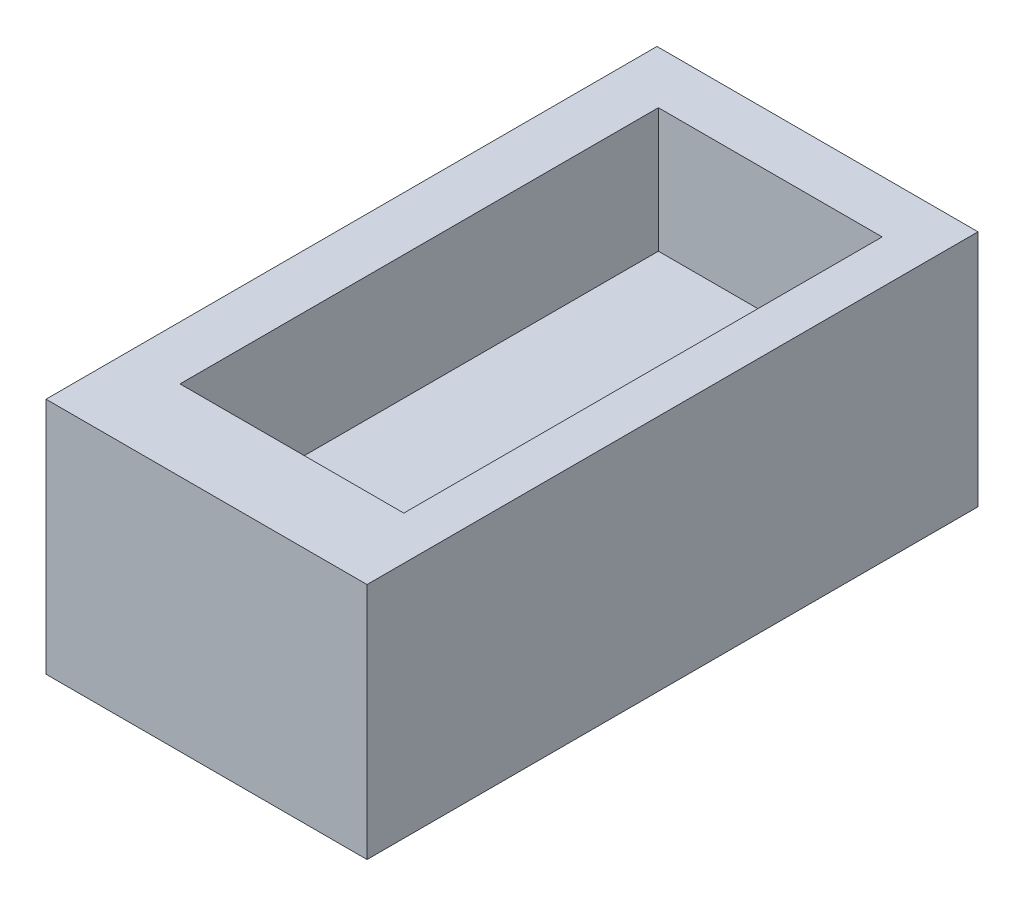
ISO-10303-21;
HEADER;
FILE_DESCRIPTION(('STEP AP214'),'2;1');
FILE_NAME('part.step','',(''),(''),'','','');
FILE_SCHEMA(('AUTOMOTIVE_DESIGN { 1 0 10303 214 1 1 1 1 }'));
ENDSEC;
DATA;
#1=APPLICATION_CONTEXT('core data for automotive mechanical design processes');
#2=APPLICATION_PROTOCOL_DEFINITION('international standard','automotive_design',2000,#1);
#3=PRODUCT_CONTEXT('',#1,'mechanical');
#4=PRODUCT('Part','Part','',(#3));
#5=PRODUCT_RELATED_PRODUCT_CATEGORY('part','',(#4));
#6=PRODUCT_DEFINITION_FORMATION('','',#4);
#7=PRODUCT_DEFINITION_CONTEXT('part definition',#1,'design');
#8=PRODUCT_DEFINITION('design','',#6,#7);
#9=PRODUCT_DEFINITION_SHAPE('','',#8);
#10=(LENGTH_UNIT() NAMED_UNIT(*) SI_UNIT(.MILLI.,.METRE.));
#11=(NAMED_UNIT(*) PLANE_ANGLE_UNIT() SI_UNIT($,.RADIAN.));
#12=(NAMED_UNIT(*) SI_UNIT($,.STERADIAN.) SOLID_ANGLE_UNIT());
#13=UNCERTAINTY_MEASURE_WITH_UNIT(LENGTH_MEASURE(1.E-05),#10,'distance_accuracy_value','');
#14=(GEOMETRIC_REPRESENTATION_CONTEXT(3) GLOBAL_UNCERTAINTY_ASSIGNED_CONTEXT((#13)) GLOBAL_UNIT_ASSIGNED_CONTEXT((#10,
#11,#12)) REPRESENTATION_CONTEXT('',''));
#15=CARTESIAN_POINT('',(0.,0.,0.));
#16=DIRECTION('',(0.,0.,1.));
#17=DIRECTION('',(1.,0.,0.));
#18=AXIS2_PLACEMENT_3D('',#15,#16,#17);
#19=CARTESIAN_POINT('',(-15.5,23.,29.5));
#20=DIRECTION('',(1.,0.,0.));
#21=DIRECTION('',(0.,0.,-1.));
#22=AXIS2_PLACEMENT_3D('',#19,#20,#21);
#23=PLANE('',#22);
#24=DIRECTION('',(0.,0.,1.));
#25=VECTOR('',#24,1.);
#26=CARTESIAN_POINT('',(-15.5,0.,29.5));
#27=LINE('',#26,#25);
#28=CARTESIAN_POINT('',(-15.5,0.,-29.5));
#29=VERTEX_POINT('',#28);
#30=CARTESIAN_POINT('',(-15.5,0.,29.5));
#31=VERTEX_POINT('',#30);
#32=EDGE_CURVE('E144',#29,#31,#27,.T.);
#33=ORIENTED_EDGE('',*,*,#32,.T.);
#34=DIRECTION('',(0.,-1.,0.));
#35=VECTOR('',#34,1.);
#36=CARTESIAN_POINT('',(-15.5,23.,29.5));
#37=LINE('',#36,#35);
#38=CARTESIAN_POINT('',(-15.5,23.,29.5));
#39=VERTEX_POINT('',#38);
#40=EDGE_CURVE('E11',#39,#31,#37,.T.);
#41=ORIENTED_EDGE('',*,*,#40,.F.);
#42=DIRECTION('',(0.,0.,1.));
#43=VECTOR('',#42,1.);
#44=CARTESIAN_POINT('',(-15.5,23.,29.5));
#45=LINE('',#44,#43);
#46=CARTESIAN_POINT('',(-15.5,23.,-29.5));
#47=VERTEX_POINT('',#46);
#48=EDGE_CURVE('E148',#47,#39,#45,.T.);
#49=ORIENTED_EDGE('',*,*,#48,.F.);
#50=DIRECTION('',(0.,-1.,0.));
#51=VECTOR('',#50,1.);
#52=CARTESIAN_POINT('',(-15.5,23.,-29.5));
#53=LINE('',#52,#51);
#54=EDGE_CURVE('E154',#47,#29,#53,.T.);
#55=ORIENTED_EDGE('',*,*,#54,.T.);
#56=EDGE_LOOP('',(#33,#41,#49,#55));
#57=FACE_BOUND('',#56,.T.);
#58=ADVANCED_FACE('F36',(#57),#23,.F.);
#59=CARTESIAN_POINT('',(15.5,23.,29.5));
#60=DIRECTION('',(0.,0.,-1.));
#61=DIRECTION('',(-1.,0.,0.));
#62=AXIS2_PLACEMENT_3D('',#59,#60,#61);
#63=PLANE('',#62);
#64=DIRECTION('',(1.,0.,0.));
#65=VECTOR('',#64,1.);
#66=CARTESIAN_POINT('',(15.5,0.,29.5));
#67=LINE('',#66,#65);
#68=CARTESIAN_POINT('',(15.5,0.,29.5));
#69=VERTEX_POINT('',#68);
#70=EDGE_CURVE('E157',#31,#69,#67,.T.);
#71=ORIENTED_EDGE('',*,*,#70,.T.);
#72=DIRECTION('',(0.,-1.,0.));
#73=VECTOR('',#72,1.);
#74=CARTESIAN_POINT('',(15.5,23.,29.5));
#75=LINE('',#74,#73);
#76=CARTESIAN_POINT('',(15.5,23.,29.5));
#77=VERTEX_POINT('',#76);
#78=EDGE_CURVE('E43',#77,#69,#75,.T.);
#79=ORIENTED_EDGE('',*,*,#78,.F.);
#80=DIRECTION('',(1.,0.,0.));
#81=VECTOR('',#80,1.);
#82=CARTESIAN_POINT('',(15.5,23.,29.5));
#83=LINE('',#82,#81);
#84=EDGE_CURVE('E87',#39,#77,#83,.T.);
#85=ORIENTED_EDGE('',*,*,#84,.F.);
#86=ORIENTED_EDGE('',*,*,#40,.T.);
#87=EDGE_LOOP('',(#71,#79,#85,#86));
#88=FACE_BOUND('',#87,.T.);
#89=ADVANCED_FACE('F186',(#88),#63,.F.);
#90=CARTESIAN_POINT('',(15.5,23.,29.5));
#91=DIRECTION('',(-1.,0.,0.));
#92=DIRECTION('',(0.,0.,1.));
#93=AXIS2_PLACEMENT_3D('',#90,#91,#92);
#94=PLANE('',#93);
#95=DIRECTION('',(0.,0.,-1.));
#96=VECTOR('',#95,1.);
#97=CARTESIAN_POINT('',(15.5,0.,29.5));
#98=LINE('',#97,#96);
#99=CARTESIAN_POINT('',(15.5,0.,-29.5));
#100=VERTEX_POINT('',#99);
#101=EDGE_CURVE('E159',#69,#100,#98,.T.);
#102=ORIENTED_EDGE('',*,*,#101,.T.);
#103=DIRECTION('',(0.,-1.,0.));
#104=VECTOR('',#103,1.);
#105=CARTESIAN_POINT('',(15.5,23.,-29.5));
#106=LINE('',#105,#104);
#107=CARTESIAN_POINT('',(15.5,23.,-29.5));
#108=VERTEX_POINT('',#107);
#109=EDGE_CURVE('E163',#108,#100,#106,.T.);
#110=ORIENTED_EDGE('',*,*,#109,.F.);
#111=DIRECTION('',(0.,0.,-1.));
#112=VECTOR('',#111,1.);
#113=CARTESIAN_POINT('',(15.5,23.,29.5));
#114=LINE('',#113,#112);
#115=EDGE_CURVE('E151',#77,#108,#114,.T.);
#116=ORIENTED_EDGE('',*,*,#115,.F.);
#117=ORIENTED_EDGE('',*,*,#78,.T.);
#118=EDGE_LOOP('',(#102,#110,#116,#117));
#119=FACE_BOUND('',#118,.T.);
#120=ADVANCED_FACE('F168',(#119),#94,.F.);
#121=CARTESIAN_POINT('',(15.5,23.,-29.5));
#122=DIRECTION('',(0.,0.,1.));
#123=DIRECTION('',(1.,0.,0.));
#124=AXIS2_PLACEMENT_3D('',#121,#122,#123);
#125=PLANE('',#124);
#126=DIRECTION('',(-1.,0.,0.));
#127=VECTOR('',#126,1.);
#128=CARTESIAN_POINT('',(15.5,0.,-29.5));
#129=LINE('',#128,#127);
#130=EDGE_CURVE('E80',#100,#29,#129,.T.);
#131=ORIENTED_EDGE('',*,*,#130,.T.);
#132=ORIENTED_EDGE('',*,*,#54,.F.);
#133=DIRECTION('',(-1.,0.,0.));
#134=VECTOR('',#133,1.);
#135=CARTESIAN_POINT('',(15.5,23.,-29.5));
#136=LINE('',#135,#134);
#137=EDGE_CURVE('E59',#108,#47,#136,.T.);
#138=ORIENTED_EDGE('',*,*,#137,.F.);
#139=ORIENTED_EDGE('',*,*,#109,.T.);
#140=EDGE_LOOP('',(#131,#132,#138,#139));
#141=FACE_BOUND('',#140,.T.);
#142=ADVANCED_FACE('F176',(#141),#125,.F.);
#143=CARTESIAN_POINT('',(0.,23.,0.));
#144=DIRECTION('',(0.,1.,0.));
#145=DIRECTION('',(0.,0.,1.));
#146=AXIS2_PLACEMENT_3D('',#143,#144,#145);
#147=PLANE('',#146);
#148=DIRECTION('',(0.,0.,1.));
#149=VECTOR('',#148,1.);
#150=CARTESIAN_POINT('',(-10.3074651415298,23.,-24.4444253245888));
#151=LINE('',#150,#149);
#152=CARTESIAN_POINT('',(-10.3074651415298,23.,-24.4444253245888));
#153=VERTEX_POINT('',#152);
#154=CARTESIAN_POINT('',(-10.3074651415298,23.,21.749943455478));
#155=VERTEX_POINT('',#154);
#156=EDGE_CURVE('E50',#153,#155,#151,.T.);
#157=ORIENTED_EDGE('',*,*,#156,.F.);
#158=DIRECTION('',(-1.,0.,0.));
#159=VECTOR('',#158,1.);
#160=CARTESIAN_POINT('',(-10.3074651415298,23.,-24.4444253245888));
#161=LINE('',#160,#159);
#162=CARTESIAN_POINT('',(11.3017315139032,23.,-24.4444253245888));
#163=VERTEX_POINT('',#162);
#164=EDGE_CURVE('E129',#163,#153,#161,.T.);
#165=ORIENTED_EDGE('',*,*,#164,.F.);
#166=DIRECTION('',(0.,0.,-1.));
#167=VECTOR('',#166,1.);
#168=CARTESIAN_POINT('',(11.3017315139032,23.,-24.4444253245888));
#169=LINE('',#168,#167);
#170=CARTESIAN_POINT('',(11.3017315139032,23.,21.749943455478));
#171=VERTEX_POINT('',#170);
#172=EDGE_CURVE('E132',#171,#163,#169,.T.);
#173=ORIENTED_EDGE('',*,*,#172,.F.);
#174=DIRECTION('',(1.,0.,0.));
#175=VECTOR('',#174,1.);
#176=CARTESIAN_POINT('',(-10.3074651415298,23.,21.749943455478));
#177=LINE('',#176,#175);
#178=EDGE_CURVE('E138',#155,#171,#177,.T.);
#179=ORIENTED_EDGE('',*,*,#178,.F.);
#180=EDGE_LOOP('',(#157,#165,#173,#179));
#181=FACE_BOUND('',#180,.T.);
#182=ORIENTED_EDGE('',*,*,#48,.T.);
#183=ORIENTED_EDGE('',*,*,#84,.T.);
#184=ORIENTED_EDGE('',*,*,#115,.T.);
#185=ORIENTED_EDGE('',*,*,#137,.T.);
#186=EDGE_LOOP('',(#182,#183,#184,#185));
#187=FACE_BOUND('',#186,.T.);
#188=ADVANCED_FACE('F178',(#181,#187),#147,.T.);
#189=CARTESIAN_POINT('',(0.,0.,0.));
#190=DIRECTION('',(0.,1.,0.));
#191=DIRECTION('',(0.,0.,1.));
#192=AXIS2_PLACEMENT_3D('',#189,#190,#191);
#193=PLANE('',#192);
#194=ORIENTED_EDGE('',*,*,#32,.F.);
#195=ORIENTED_EDGE('',*,*,#130,.F.);
#196=ORIENTED_EDGE('',*,*,#101,.F.);
#197=ORIENTED_EDGE('',*,*,#70,.F.);
#198=EDGE_LOOP('',(#194,#195,#196,#197));
#199=FACE_BOUND('',#198,.T.);
#200=ADVANCED_FACE('F172',(#199),#193,.F.);
#201=CARTESIAN_POINT('',(-10.3074651415298,11.,-24.4444253245888));
#202=DIRECTION('',(-1.,0.,0.));
#203=DIRECTION('',(0.,0.,1.));
#204=AXIS2_PLACEMENT_3D('',#201,#202,#203);
#205=PLANE('',#204);
#206=ORIENTED_EDGE('',*,*,#156,.T.);
#207=DIRECTION('',(0.,1.,0.));
#208=VECTOR('',#207,1.);
#209=CARTESIAN_POINT('',(-10.3074651415298,11.,21.749943455478));
#210=LINE('',#209,#208);
#211=CARTESIAN_POINT('',(-10.3074651415298,11.,21.749943455478));
#212=VERTEX_POINT('',#211);
#213=EDGE_CURVE('E107',#212,#155,#210,.T.);
#214=ORIENTED_EDGE('',*,*,#213,.F.);
#215=DIRECTION('',(0.,0.,1.));
#216=VECTOR('',#215,1.);
#217=CARTESIAN_POINT('',(-10.3074651415298,11.,-24.4444253245888));
#218=LINE('',#217,#216);
#219=CARTESIAN_POINT('',(-10.3074651415298,11.,-24.4444253245888));
#220=VERTEX_POINT('',#219);
#221=EDGE_CURVE('E111',#220,#212,#218,.T.);
#222=ORIENTED_EDGE('',*,*,#221,.F.);
#223=DIRECTION('',(0.,1.,0.));
#224=VECTOR('',#223,1.);
#225=CARTESIAN_POINT('',(-10.3074651415298,11.,-24.4444253245888));
#226=LINE('',#225,#224);
#227=EDGE_CURVE('E142',#220,#153,#226,.T.);
#228=ORIENTED_EDGE('',*,*,#227,.T.);
#229=EDGE_LOOP('',(#206,#214,#222,#228));
#230=FACE_BOUND('',#229,.T.);
#231=ADVANCED_FACE('F109',(#230),#205,.F.);
#232=CARTESIAN_POINT('',(-10.3074651415298,11.,-24.4444253245888));
#233=DIRECTION('',(0.,0.,-1.));
#234=DIRECTION('',(-1.,0.,0.));
#235=AXIS2_PLACEMENT_3D('',#232,#233,#234);
#236=PLANE('',#235);
#237=ORIENTED_EDGE('',*,*,#164,.T.);
#238=ORIENTED_EDGE('',*,*,#227,.F.);
#239=DIRECTION('',(-1.,0.,0.));
#240=VECTOR('',#239,1.);
#241=CARTESIAN_POINT('',(-10.3074651415298,11.,-24.4444253245888));
#242=LINE('',#241,#240);
#243=CARTESIAN_POINT('',(11.3017315139032,11.,-24.4444253245888));
#244=VERTEX_POINT('',#243);
#245=EDGE_CURVE('E117',#244,#220,#242,.T.);
#246=ORIENTED_EDGE('',*,*,#245,.F.);
#247=DIRECTION('',(0.,1.,0.));
#248=VECTOR('',#247,1.);
#249=CARTESIAN_POINT('',(11.3017315139032,11.,-24.4444253245888));
#250=LINE('',#249,#248);
#251=EDGE_CURVE('E145',#244,#163,#250,.T.);
#252=ORIENTED_EDGE('',*,*,#251,.T.);
#253=EDGE_LOOP('',(#237,#238,#246,#252));
#254=FACE_BOUND('',#253,.T.);
#255=ADVANCED_FACE('F225',(#254),#236,.F.);
#256=CARTESIAN_POINT('',(11.3017315139032,11.,-24.4444253245888));
#257=DIRECTION('',(1.,0.,0.));
#258=DIRECTION('',(0.,0.,-1.));
#259=AXIS2_PLACEMENT_3D('',#256,#257,#258);
#260=PLANE('',#259);
#261=ORIENTED_EDGE('',*,*,#172,.T.);
#262=ORIENTED_EDGE('',*,*,#251,.F.);
#263=DIRECTION('',(0.,0.,-1.));
#264=VECTOR('',#263,1.);
#265=CARTESIAN_POINT('',(11.3017315139032,11.,-24.4444253245888));
#266=LINE('',#265,#264);
#267=CARTESIAN_POINT('',(11.3017315139032,11.,21.749943455478));
#268=VERTEX_POINT('',#267);
#269=EDGE_CURVE('E125',#268,#244,#266,.T.);
#270=ORIENTED_EDGE('',*,*,#269,.F.);
#271=DIRECTION('',(0.,1.,0.));
#272=VECTOR('',#271,1.);
#273=CARTESIAN_POINT('',(11.3017315139032,11.,21.749943455478));
#274=LINE('',#273,#272);
#275=EDGE_CURVE('E116',#268,#171,#274,.T.);
#276=ORIENTED_EDGE('',*,*,#275,.T.);
#277=EDGE_LOOP('',(#261,#262,#270,#276));
#278=FACE_BOUND('',#277,.T.);
#279=ADVANCED_FACE('F234',(#278),#260,.F.);
#280=CARTESIAN_POINT('',(-10.3074651415298,11.,21.749943455478));
#281=DIRECTION('',(0.,0.,1.));
#282=DIRECTION('',(1.,0.,0.));
#283=AXIS2_PLACEMENT_3D('',#280,#281,#282);
#284=PLANE('',#283);
#285=ORIENTED_EDGE('',*,*,#178,.T.);
#286=ORIENTED_EDGE('',*,*,#275,.F.);
#287=DIRECTION('',(1.,0.,0.));
#288=VECTOR('',#287,1.);
#289=CARTESIAN_POINT('',(-10.3074651415298,11.,21.749943455478));
#290=LINE('',#289,#288);
#291=EDGE_CURVE('E120',#212,#268,#290,.T.);
#292=ORIENTED_EDGE('',*,*,#291,.F.);
#293=ORIENTED_EDGE('',*,*,#213,.T.);
#294=EDGE_LOOP('',(#285,#286,#292,#293));
#295=FACE_BOUND('',#294,.T.);
#296=ADVANCED_FACE('F121',(#295),#284,.F.);
#297=CARTESIAN_POINT('',(0.,11.,0.));
#298=DIRECTION('',(0.,1.,0.));
#299=DIRECTION('',(0.,0.,1.));
#300=AXIS2_PLACEMENT_3D('',#297,#298,#299);
#301=PLANE('',#300);
#302=ORIENTED_EDGE('',*,*,#221,.T.);
#303=ORIENTED_EDGE('',*,*,#291,.T.);
#304=ORIENTED_EDGE('',*,*,#269,.T.);
#305=ORIENTED_EDGE('',*,*,#245,.T.);
#306=EDGE_LOOP('',(#302,#303,#304,#305));
#307=FACE_BOUND('',#306,.T.);
#308=ADVANCED_FACE('F127',(#307),#301,.T.);
#309=CLOSED_SHELL('',(#58,#89,#120,#142,#188,#200,#231,#255,#279,#296,#308));
#310=MANIFOLD_SOLID_BREP('B2',#309);
#311=ADVANCED_BREP_SHAPE_REPRESENTATION('',(#18,#310),#14);
#312=SHAPE_DEFINITION_REPRESENTATION(#9,#311);
ENDSEC;
END-ISO-10303-21;
